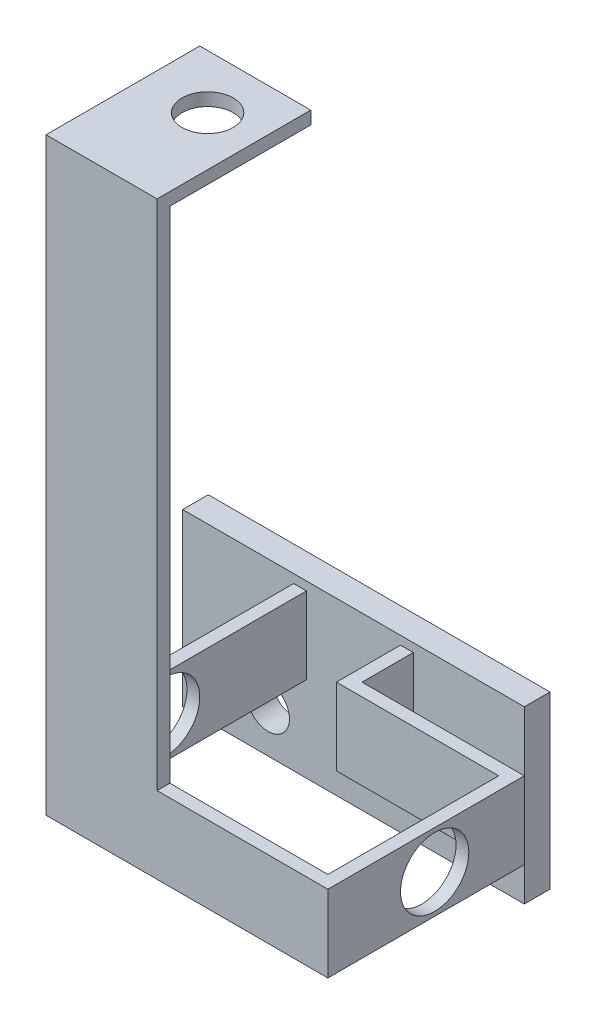
ISO-10303-21;
HEADER;
FILE_DESCRIPTION(('STEP AP214'),'2;1');
FILE_NAME('part.step','',(''),(''),'','','');
FILE_SCHEMA(('AUTOMOTIVE_DESIGN { 1 0 10303 214 1 1 1 1 }'));
ENDSEC;
DATA;
#1=APPLICATION_CONTEXT('core data for automotive mechanical design processes');
#2=APPLICATION_PROTOCOL_DEFINITION('international standard','automotive_design',2000,#1);
#3=PRODUCT_CONTEXT('',#1,'mechanical');
#4=PRODUCT('Part','Part','',(#3));
#5=PRODUCT_RELATED_PRODUCT_CATEGORY('part','',(#4));
#6=PRODUCT_DEFINITION_FORMATION('','',#4);
#7=PRODUCT_DEFINITION_CONTEXT('part definition',#1,'design');
#8=PRODUCT_DEFINITION('design','',#6,#7);
#9=PRODUCT_DEFINITION_SHAPE('','',#8);
#10=(LENGTH_UNIT() NAMED_UNIT(*) SI_UNIT(.MILLI.,.METRE.));
#11=(NAMED_UNIT(*) PLANE_ANGLE_UNIT() SI_UNIT($,.RADIAN.));
#12=(NAMED_UNIT(*) SI_UNIT($,.STERADIAN.) SOLID_ANGLE_UNIT());
#13=UNCERTAINTY_MEASURE_WITH_UNIT(LENGTH_MEASURE(1.E-05),#10,'distance_accuracy_value','');
#14=(GEOMETRIC_REPRESENTATION_CONTEXT(3) GLOBAL_UNCERTAINTY_ASSIGNED_CONTEXT((#13)) GLOBAL_UNIT_ASSIGNED_CONTEXT((#10,
#11,#12)) REPRESENTATION_CONTEXT('',''));
#15=CARTESIAN_POINT('',(0.,0.,0.));
#16=DIRECTION('',(0.,0.,1.));
#17=DIRECTION('',(1.,0.,0.));
#18=AXIS2_PLACEMENT_3D('',#15,#16,#17);
#19=CARTESIAN_POINT('',(13.,79.,22.));
#20=DIRECTION('',(0.,0.,1.));
#21=DIRECTION('',(1.,0.,0.));
#22=AXIS2_PLACEMENT_3D('',#19,#20,#21);
#23=PLANE('',#22);
#24=DIRECTION('',(0.,-1.,0.));
#25=VECTOR('',#24,1.);
#26=CARTESIAN_POINT('',(13.,79.,22.));
#27=LINE('',#26,#25);
#28=CARTESIAN_POINT('',(13.,42.5,22.));
#29=VERTEX_POINT('',#28);
#30=CARTESIAN_POINT('',(13.,19.,22.));
#31=VERTEX_POINT('',#30);
#32=EDGE_CURVE('E237',#29,#31,#27,.T.);
#33=ORIENTED_EDGE('',*,*,#32,.F.);
#34=DIRECTION('',(1.,0.,0.));
#35=VECTOR('',#34,1.);
#36=CARTESIAN_POINT('',(13.,42.5,22.));
#37=LINE('',#36,#35);
#38=CARTESIAN_POINT('',(14.5,42.5,22.));
#39=VERTEX_POINT('',#38);
#40=EDGE_CURVE('E245',#29,#39,#37,.T.);
#41=ORIENTED_EDGE('',*,*,#40,.T.);
#42=DIRECTION('',(0.,-1.,0.));
#43=VECTOR('',#42,1.);
#44=CARTESIAN_POINT('',(14.5,93.3003496460751,22.));
#45=LINE('',#44,#43);
#46=CARTESIAN_POINT('',(14.5,19.,22.));
#47=VERTEX_POINT('',#46);
#48=EDGE_CURVE('E278',#39,#47,#45,.T.);
#49=ORIENTED_EDGE('',*,*,#48,.T.);
#50=DIRECTION('',(-1.,0.,0.));
#51=VECTOR('',#50,1.);
#52=CARTESIAN_POINT('',(13.,19.,22.));
#53=LINE('',#52,#51);
#54=EDGE_CURVE('E248',#47,#31,#53,.T.);
#55=ORIENTED_EDGE('',*,*,#54,.T.);
#56=EDGE_LOOP('',(#33,#41,#49,#55));
#57=FACE_BOUND('',#56,.T.);
#58=ADVANCED_FACE('F46',(#57),#23,.F.);
#59=CARTESIAN_POINT('',(0.,19.,32.));
#60=DIRECTION('',(0.,-1.,0.));
#61=DIRECTION('',(0.,0.,-1.));
#62=AXIS2_PLACEMENT_3D('',#59,#60,#61);
#63=PLANE('',#62);
#64=DIRECTION('',(0.,0.,-1.));
#65=VECTOR('',#64,1.);
#66=CARTESIAN_POINT('',(26.,19.,32.));
#67=LINE('',#66,#65);
#68=CARTESIAN_POINT('',(26.,19.,32.));
#69=VERTEX_POINT('',#68);
#70=CARTESIAN_POINT('',(26.,19.,30.5));
#71=VERTEX_POINT('',#70);
#72=EDGE_CURVE('E285',#69,#71,#67,.T.);
#73=ORIENTED_EDGE('',*,*,#72,.F.);
#74=DIRECTION('',(-1.,0.,0.));
#75=VECTOR('',#74,1.);
#76=CARTESIAN_POINT('',(0.,19.,32.));
#77=LINE('',#76,#75);
#78=CARTESIAN_POINT('',(46.,19.,32.));
#79=VERTEX_POINT('',#78);
#80=EDGE_CURVE('E468',#79,#69,#77,.T.);
#81=ORIENTED_EDGE('',*,*,#80,.F.);
#82=DIRECTION('',(0.,0.,1.));
#83=VECTOR('',#82,1.);
#84=CARTESIAN_POINT('',(46.,19.,32.));
#85=LINE('',#84,#83);
#86=CARTESIAN_POINT('',(46.,19.,9.));
#87=VERTEX_POINT('',#86);
#88=EDGE_CURVE('E347',#87,#79,#85,.T.);
#89=ORIENTED_EDGE('',*,*,#88,.F.);
#90=DIRECTION('',(-1.,0.,0.));
#91=VECTOR('',#90,1.);
#92=CARTESIAN_POINT('',(46.,19.,9.));
#93=LINE('',#92,#91);
#94=CARTESIAN_POINT('',(27.,19.,9.));
#95=VERTEX_POINT('',#94);
#96=EDGE_CURVE('E351',#87,#95,#93,.T.);
#97=ORIENTED_EDGE('',*,*,#96,.T.);
#98=DIRECTION('',(0.,0.,-1.));
#99=VECTOR('',#98,1.);
#100=CARTESIAN_POINT('',(27.,19.,32.));
#101=LINE('',#100,#99);
#102=CARTESIAN_POINT('',(27.,19.,3.));
#103=VERTEX_POINT('',#102);
#104=EDGE_CURVE('E482',#95,#103,#101,.T.);
#105=ORIENTED_EDGE('',*,*,#104,.T.);
#106=DIRECTION('',(-1.,0.,0.));
#107=VECTOR('',#106,1.);
#108=CARTESIAN_POINT('',(0.,19.,3.));
#109=LINE('',#108,#107);
#110=CARTESIAN_POINT('',(25.5,19.,3.));
#111=VERTEX_POINT('',#110);
#112=EDGE_CURVE('E405',#103,#111,#109,.T.);
#113=ORIENTED_EDGE('',*,*,#112,.T.);
#114=DIRECTION('',(0.,0.,1.));
#115=VECTOR('',#114,1.);
#116=CARTESIAN_POINT('',(25.5,19.,32.));
#117=LINE('',#116,#115);
#118=CARTESIAN_POINT('',(25.5,19.,10.5));
#119=VERTEX_POINT('',#118);
#120=EDGE_CURVE('E378',#111,#119,#117,.T.);
#121=ORIENTED_EDGE('',*,*,#120,.T.);
#122=DIRECTION('',(1.,0.,0.));
#123=VECTOR('',#122,1.);
#124=CARTESIAN_POINT('',(0.,19.,10.5));
#125=LINE('',#124,#123);
#126=CARTESIAN_POINT('',(44.5,19.,10.5));
#127=VERTEX_POINT('',#126);
#128=EDGE_CURVE('E322',#119,#127,#125,.T.);
#129=ORIENTED_EDGE('',*,*,#128,.T.);
#130=DIRECTION('',(0.,0.,1.));
#131=VECTOR('',#130,1.);
#132=CARTESIAN_POINT('',(44.5,19.,32.));
#133=LINE('',#132,#131);
#134=CARTESIAN_POINT('',(44.5,19.,30.5));
#135=VERTEX_POINT('',#134);
#136=EDGE_CURVE('E496',#127,#135,#133,.T.);
#137=ORIENTED_EDGE('',*,*,#136,.T.);
#138=DIRECTION('',(-1.,0.,0.));
#139=VECTOR('',#138,1.);
#140=CARTESIAN_POINT('',(0.,19.,30.5));
#141=LINE('',#140,#139);
#142=EDGE_CURVE('E488',#135,#71,#141,.T.);
#143=ORIENTED_EDGE('',*,*,#142,.T.);
#144=EDGE_LOOP('',(#73,#81,#89,#97,#105,#113,#121,#129,#137,#143));
#145=FACE_BOUND('',#144,.T.);
#146=ADVANCED_FACE('F562',(#145),#63,.F.);
#147=ORIENTED_EDGE('',*,*,#54,.F.);
#148=DIRECTION('',(0.,0.,-1.));
#149=VECTOR('',#148,1.);
#150=CARTESIAN_POINT('',(14.5,19.,32.));
#151=LINE('',#150,#149);
#152=CARTESIAN_POINT('',(14.5,19.,3.));
#153=VERTEX_POINT('',#152);
#154=EDGE_CURVE('E367',#47,#153,#151,.T.);
#155=ORIENTED_EDGE('',*,*,#154,.T.);
#156=CARTESIAN_POINT('',(13.,19.,3.));
#157=VERTEX_POINT('',#156);
#158=EDGE_CURVE('E404',#153,#157,#109,.T.);
#159=ORIENTED_EDGE('',*,*,#158,.T.);
#160=DIRECTION('',(0.,0.,-1.));
#161=VECTOR('',#160,1.);
#162=CARTESIAN_POINT('',(13.,19.,32.));
#163=LINE('',#162,#161);
#164=EDGE_CURVE('E479',#31,#157,#163,.T.);
#165=ORIENTED_EDGE('',*,*,#164,.F.);
#166=EDGE_LOOP('',(#147,#155,#159,#165));
#167=FACE_BOUND('',#166,.T.);
#168=ADVANCED_FACE('F512',(#167),#63,.F.);
#169=CARTESIAN_POINT('',(27.,0.,32.));
#170=DIRECTION('',(1.,0.,0.));
#171=DIRECTION('',(0.,1.,0.));
#172=AXIS2_PLACEMENT_3D('',#169,#170,#171);
#173=PLANE('',#172);
#174=ORIENTED_EDGE('',*,*,#104,.F.);
#175=DIRECTION('',(0.,1.,0.));
#176=VECTOR('',#175,1.);
#177=CARTESIAN_POINT('',(27.,19.,9.));
#178=LINE('',#177,#176);
#179=CARTESIAN_POINT('',(27.,10.,9.));
#180=VERTEX_POINT('',#179);
#181=EDGE_CURVE('E336',#180,#95,#178,.T.);
#182=ORIENTED_EDGE('',*,*,#181,.F.);
#183=DIRECTION('',(0.,0.,-1.));
#184=VECTOR('',#183,1.);
#185=CARTESIAN_POINT('',(27.,10.,32.));
#186=LINE('',#185,#184);
#187=CARTESIAN_POINT('',(27.,10.,3.));
#188=VERTEX_POINT('',#187);
#189=EDGE_CURVE('E485',#180,#188,#186,.T.);
#190=ORIENTED_EDGE('',*,*,#189,.T.);
#191=DIRECTION('',(0.,-1.,0.));
#192=VECTOR('',#191,1.);
#193=CARTESIAN_POINT('',(27.,0.,3.));
#194=LINE('',#193,#192);
#195=EDGE_CURVE('E390',#103,#188,#194,.T.);
#196=ORIENTED_EDGE('',*,*,#195,.F.);
#197=EDGE_LOOP('',(#174,#182,#190,#196));
#198=FACE_BOUND('',#197,.T.);
#199=ADVANCED_FACE('F608',(#198),#173,.T.);
#200=CARTESIAN_POINT('',(0.,10.,32.));
#201=DIRECTION('',(0.,-1.,0.));
#202=DIRECTION('',(1.,0.,0.));
#203=AXIS2_PLACEMENT_3D('',#200,#201,#202);
#204=PLANE('',#203);
#205=DIRECTION('',(1.,0.,0.));
#206=VECTOR('',#205,1.);
#207=CARTESIAN_POINT('',(0.,10.,10.5));
#208=LINE('',#207,#206);
#209=CARTESIAN_POINT('',(25.5,10.,10.5));
#210=VERTEX_POINT('',#209);
#211=CARTESIAN_POINT('',(44.5,10.,10.5));
#212=VERTEX_POINT('',#211);
#213=EDGE_CURVE('E329',#210,#212,#208,.T.);
#214=ORIENTED_EDGE('',*,*,#213,.F.);
#215=DIRECTION('',(0.,0.,1.));
#216=VECTOR('',#215,1.);
#217=CARTESIAN_POINT('',(25.5,10.,32.));
#218=LINE('',#217,#216);
#219=CARTESIAN_POINT('',(25.5,10.,3.));
#220=VERTEX_POINT('',#219);
#221=EDGE_CURVE('E382',#220,#210,#218,.T.);
#222=ORIENTED_EDGE('',*,*,#221,.F.);
#223=DIRECTION('',(-1.,0.,0.));
#224=VECTOR('',#223,1.);
#225=CARTESIAN_POINT('',(0.,10.,3.));
#226=LINE('',#225,#224);
#227=EDGE_CURVE('E396',#188,#220,#226,.T.);
#228=ORIENTED_EDGE('',*,*,#227,.F.);
#229=ORIENTED_EDGE('',*,*,#189,.F.);
#230=DIRECTION('',(-1.,0.,0.));
#231=VECTOR('',#230,1.);
#232=CARTESIAN_POINT('',(46.,10.,9.));
#233=LINE('',#232,#231);
#234=CARTESIAN_POINT('',(46.,10.,9.));
#235=VERTEX_POINT('',#234);
#236=EDGE_CURVE('E358',#235,#180,#233,.T.);
#237=ORIENTED_EDGE('',*,*,#236,.F.);
#238=DIRECTION('',(0.,0.,-1.));
#239=VECTOR('',#238,1.);
#240=CARTESIAN_POINT('',(46.,10.,32.));
#241=LINE('',#240,#239);
#242=CARTESIAN_POINT('',(46.,10.,32.));
#243=VERTEX_POINT('',#242);
#244=EDGE_CURVE('E341',#243,#235,#241,.T.);
#245=ORIENTED_EDGE('',*,*,#244,.F.);
#246=DIRECTION('',(-1.,0.,0.));
#247=VECTOR('',#246,1.);
#248=CARTESIAN_POINT('',(0.,10.,32.));
#249=LINE('',#248,#247);
#250=CARTESIAN_POINT('',(13.,10.,32.));
#251=VERTEX_POINT('',#250);
#252=EDGE_CURVE('E464',#243,#251,#249,.T.);
#253=ORIENTED_EDGE('',*,*,#252,.T.);
#254=DIRECTION('',(0.,0.,-1.));
#255=VECTOR('',#254,1.);
#256=CARTESIAN_POINT('',(13.,10.,32.));
#257=LINE('',#256,#255);
#258=CARTESIAN_POINT('',(13.,10.,3.));
#259=VERTEX_POINT('',#258);
#260=EDGE_CURVE('E475',#251,#259,#257,.T.);
#261=ORIENTED_EDGE('',*,*,#260,.T.);
#262=CARTESIAN_POINT('',(14.5,10.,3.));
#263=VERTEX_POINT('',#262);
#264=EDGE_CURVE('E394',#263,#259,#226,.T.);
#265=ORIENTED_EDGE('',*,*,#264,.F.);
#266=DIRECTION('',(0.,0.,-1.));
#267=VECTOR('',#266,1.);
#268=CARTESIAN_POINT('',(14.5,10.,32.));
#269=LINE('',#268,#267);
#270=CARTESIAN_POINT('',(14.5,10.,30.5));
#271=VERTEX_POINT('',#270);
#272=EDGE_CURVE('E375',#271,#263,#269,.T.);
#273=ORIENTED_EDGE('',*,*,#272,.F.);
#274=DIRECTION('',(-1.,0.,0.));
#275=VECTOR('',#274,1.);
#276=CARTESIAN_POINT('',(0.,10.,30.5));
#277=LINE('',#276,#275);
#278=CARTESIAN_POINT('',(44.5,10.,30.5));
#279=VERTEX_POINT('',#278);
#280=EDGE_CURVE('E386',#279,#271,#277,.T.);
#281=ORIENTED_EDGE('',*,*,#280,.F.);
#282=DIRECTION('',(0.,0.,1.));
#283=VECTOR('',#282,1.);
#284=CARTESIAN_POINT('',(44.5,10.,32.));
#285=LINE('',#284,#283);
#286=EDGE_CURVE('E332',#212,#279,#285,.T.);
#287=ORIENTED_EDGE('',*,*,#286,.F.);
#288=EDGE_LOOP('',(#214,#222,#228,#229,#237,#245,#253,#261,#265,#273,#281,#287));
#289=FACE_BOUND('',#288,.T.);
#290=ADVANCED_FACE('F519',(#289),#204,.T.);
#291=CARTESIAN_POINT('',(13.,0.,32.));
#292=DIRECTION('',(1.,0.,0.));
#293=DIRECTION('',(0.,1.,0.));
#294=AXIS2_PLACEMENT_3D('',#291,#292,#293);
#295=PLANE('',#294);
#296=CARTESIAN_POINT('',(13.,14.5,19.5));
#297=DIRECTION('',(1.,0.,0.));
#298=DIRECTION('',(0.,1.,0.));
#299=AXIS2_PLACEMENT_3D('',#296,#297,#298);
#300=CIRCLE('',#299,4.);
#301=CARTESIAN_POINT('',(13.,18.5,19.5));
#302=VERTEX_POINT('',#301);
#303=EDGE_CURVE('E313',#302,#302,#300,.T.);
#304=ORIENTED_EDGE('',*,*,#303,.T.);
#305=EDGE_LOOP('',(#304));
#306=FACE_BOUND('',#305,.T.);
#307=DIRECTION('',(0.,0.,1.));
#308=VECTOR('',#307,1.);
#309=CARTESIAN_POINT('',(13.,77.5,14.));
#310=LINE('',#309,#308);
#311=CARTESIAN_POINT('',(13.,77.5,14.));
#312=VERTEX_POINT('',#311);
#313=CARTESIAN_POINT('',(13.,77.5,30.5));
#314=VERTEX_POINT('',#313);
#315=EDGE_CURVE('E276',#312,#314,#310,.T.);
#316=ORIENTED_EDGE('',*,*,#315,.T.);
#317=DIRECTION('',(0.,-1.,0.));
#318=VECTOR('',#317,1.);
#319=CARTESIAN_POINT('',(13.,77.5,30.5));
#320=LINE('',#319,#318);
#321=CARTESIAN_POINT('',(13.,52.3868599666426,30.5));
#322=VERTEX_POINT('',#321);
#323=EDGE_CURVE('E239',#314,#322,#320,.T.);
#324=ORIENTED_EDGE('',*,*,#323,.T.);
#325=CARTESIAN_POINT('',(13.,52.3868599666426,20.5));
#326=DIRECTION('',(1.,0.,0.));
#327=DIRECTION('',(0.,1.,0.));
#328=AXIS2_PLACEMENT_3D('',#325,#326,#327);
#329=CIRCLE('',#328,10.);
#330=EDGE_CURVE('E12',#322,#29,#329,.T.);
#331=ORIENTED_EDGE('',*,*,#330,.T.);
#332=ORIENTED_EDGE('',*,*,#32,.T.);
#333=ORIENTED_EDGE('',*,*,#164,.T.);
#334=DIRECTION('',(0.,-1.,0.));
#335=VECTOR('',#334,1.);
#336=CARTESIAN_POINT('',(13.,0.,3.));
#337=LINE('',#336,#335);
#338=EDGE_CURVE('E400',#157,#259,#337,.T.);
#339=ORIENTED_EDGE('',*,*,#338,.T.);
#340=ORIENTED_EDGE('',*,*,#260,.F.);
#341=DIRECTION('',(0.,-1.,0.));
#342=VECTOR('',#341,1.);
#343=CARTESIAN_POINT('',(13.,0.,32.));
#344=LINE('',#343,#342);
#345=CARTESIAN_POINT('',(13.,79.,32.));
#346=VERTEX_POINT('',#345);
#347=EDGE_CURVE('E472',#346,#251,#344,.T.);
#348=ORIENTED_EDGE('',*,*,#347,.F.);
#349=DIRECTION('',(0.,0.,1.));
#350=VECTOR('',#349,1.);
#351=CARTESIAN_POINT('',(13.,79.,32.));
#352=LINE('',#351,#350);
#353=CARTESIAN_POINT('',(13.,79.,14.));
#354=VERTEX_POINT('',#353);
#355=EDGE_CURVE('E290',#354,#346,#352,.T.);
#356=ORIENTED_EDGE('',*,*,#355,.F.);
#357=DIRECTION('',(0.,1.,0.));
#358=VECTOR('',#357,1.);
#359=CARTESIAN_POINT('',(13.,79.,14.));
#360=LINE('',#359,#358);
#361=EDGE_CURVE('E270',#312,#354,#360,.T.);
#362=ORIENTED_EDGE('',*,*,#361,.F.);
#363=EDGE_LOOP('',(#316,#324,#331,#332,#333,#339,#340,#348,#356,#362));
#364=FACE_BOUND('',#363,.T.);
#365=ADVANCED_FACE('F236',(#306,#364),#295,.F.);
#366=CARTESIAN_POINT('',(0.,0.,32.));
#367=DIRECTION('',(0.,0.,1.));
#368=DIRECTION('',(1.,0.,0.));
#369=AXIS2_PLACEMENT_3D('',#366,#367,#368);
#370=PLANE('',#369);
#371=ORIENTED_EDGE('',*,*,#252,.F.);
#372=DIRECTION('',(0.,-1.,0.));
#373=VECTOR('',#372,1.);
#374=CARTESIAN_POINT('',(46.,19.,32.));
#375=LINE('',#374,#373);
#376=EDGE_CURVE('E337',#79,#243,#375,.T.);
#377=ORIENTED_EDGE('',*,*,#376,.F.);
#378=ORIENTED_EDGE('',*,*,#80,.T.);
#379=DIRECTION('',(0.,-1.,0.));
#380=VECTOR('',#379,1.);
#381=CARTESIAN_POINT('',(26.,79.,32.));
#382=LINE('',#381,#380);
#383=CARTESIAN_POINT('',(26.,79.,32.));
#384=VERTEX_POINT('',#383);
#385=EDGE_CURVE('E250',#384,#69,#382,.T.);
#386=ORIENTED_EDGE('',*,*,#385,.F.);
#387=DIRECTION('',(1.,0.,0.));
#388=VECTOR('',#387,1.);
#389=CARTESIAN_POINT('',(13.,79.,32.));
#390=LINE('',#389,#388);
#391=EDGE_CURVE('E293',#346,#384,#390,.T.);
#392=ORIENTED_EDGE('',*,*,#391,.F.);
#393=ORIENTED_EDGE('',*,*,#347,.T.);
#394=EDGE_LOOP('',(#371,#377,#378,#386,#392,#393));
#395=FACE_BOUND('',#394,.T.);
#396=ADVANCED_FACE('F525',(#395),#370,.T.);
#397=CARTESIAN_POINT('',(0.,0.,3.));
#398=DIRECTION('',(0.,1.,0.));
#399=DIRECTION('',(0.,0.,1.));
#400=AXIS2_PLACEMENT_3D('',#397,#398,#399);
#401=PLANE('',#400);
#402=DIRECTION('',(1.,0.,0.));
#403=VECTOR('',#402,1.);
#404=CARTESIAN_POINT('',(0.,0.,0.));
#405=LINE('',#404,#403);
#406=CARTESIAN_POINT('',(0.,0.,0.));
#407=VERTEX_POINT('',#406);
#408=CARTESIAN_POINT('',(40.,0.,0.));
#409=VERTEX_POINT('',#408);
#410=EDGE_CURVE('E434',#407,#409,#405,.T.);
#411=ORIENTED_EDGE('',*,*,#410,.T.);
#412=DIRECTION('',(0.,0.,-1.));
#413=VECTOR('',#412,1.);
#414=CARTESIAN_POINT('',(40.,0.,3.));
#415=LINE('',#414,#413);
#416=CARTESIAN_POINT('',(40.,0.,3.));
#417=VERTEX_POINT('',#416);
#418=EDGE_CURVE('E461',#417,#409,#415,.T.);
#419=ORIENTED_EDGE('',*,*,#418,.F.);
#420=DIRECTION('',(1.,0.,0.));
#421=VECTOR('',#420,1.);
#422=CARTESIAN_POINT('',(0.,0.,3.));
#423=LINE('',#422,#421);
#424=CARTESIAN_POINT('',(0.,0.,3.));
#425=VERTEX_POINT('',#424);
#426=EDGE_CURVE('E413',#425,#417,#423,.T.);
#427=ORIENTED_EDGE('',*,*,#426,.F.);
#428=DIRECTION('',(0.,0.,-1.));
#429=VECTOR('',#428,1.);
#430=CARTESIAN_POINT('',(0.,0.,3.));
#431=LINE('',#430,#429);
#432=EDGE_CURVE('E430',#425,#407,#431,.T.);
#433=ORIENTED_EDGE('',*,*,#432,.T.);
#434=EDGE_LOOP('',(#411,#419,#427,#433));
#435=FACE_BOUND('',#434,.T.);
#436=ADVANCED_FACE('F638',(#435),#401,.F.);
#437=CARTESIAN_POINT('',(40.,0.,3.));
#438=DIRECTION('',(-1.,0.,0.));
#439=DIRECTION('',(0.,0.,1.));
#440=AXIS2_PLACEMENT_3D('',#437,#438,#439);
#441=PLANE('',#440);
#442=DIRECTION('',(0.,1.,0.));
#443=VECTOR('',#442,1.);
#444=CARTESIAN_POINT('',(40.,0.,0.));
#445=LINE('',#444,#443);
#446=CARTESIAN_POINT('',(40.,20.,0.));
#447=VERTEX_POINT('',#446);
#448=EDGE_CURVE('E438',#409,#447,#445,.T.);
#449=ORIENTED_EDGE('',*,*,#448,.T.);
#450=DIRECTION('',(0.,0.,-1.));
#451=VECTOR('',#450,1.);
#452=CARTESIAN_POINT('',(40.,20.,3.));
#453=LINE('',#452,#451);
#454=CARTESIAN_POINT('',(40.,20.,3.));
#455=VERTEX_POINT('',#454);
#456=EDGE_CURVE('E458',#455,#447,#453,.T.);
#457=ORIENTED_EDGE('',*,*,#456,.F.);
#458=DIRECTION('',(0.,1.,0.));
#459=VECTOR('',#458,1.);
#460=CARTESIAN_POINT('',(40.,0.,3.));
#461=LINE('',#460,#459);
#462=EDGE_CURVE('E416',#417,#455,#461,.T.);
#463=ORIENTED_EDGE('',*,*,#462,.F.);
#464=ORIENTED_EDGE('',*,*,#418,.T.);
#465=EDGE_LOOP('',(#449,#457,#463,#464));
#466=FACE_BOUND('',#465,.T.);
#467=ADVANCED_FACE('F634',(#466),#441,.F.);
#468=CARTESIAN_POINT('',(0.,20.,3.));
#469=DIRECTION('',(0.,1.,0.));
#470=DIRECTION('',(0.,0.,1.));
#471=AXIS2_PLACEMENT_3D('',#468,#469,#470);
#472=PLANE('',#471);
#473=DIRECTION('',(1.,0.,0.));
#474=VECTOR('',#473,1.);
#475=CARTESIAN_POINT('',(0.,20.,0.));
#476=LINE('',#475,#474);
#477=CARTESIAN_POINT('',(0.,20.,0.));
#478=VERTEX_POINT('',#477);
#479=EDGE_CURVE('E442',#478,#447,#476,.T.);
#480=ORIENTED_EDGE('',*,*,#479,.F.);
#481=DIRECTION('',(0.,0.,-1.));
#482=VECTOR('',#481,1.);
#483=CARTESIAN_POINT('',(0.,20.,3.));
#484=LINE('',#483,#482);
#485=CARTESIAN_POINT('',(0.,20.,3.));
#486=VERTEX_POINT('',#485);
#487=EDGE_CURVE('E455',#486,#478,#484,.T.);
#488=ORIENTED_EDGE('',*,*,#487,.F.);
#489=DIRECTION('',(1.,0.,0.));
#490=VECTOR('',#489,1.);
#491=CARTESIAN_POINT('',(0.,20.,3.));
#492=LINE('',#491,#490);
#493=EDGE_CURVE('E419',#486,#455,#492,.T.);
#494=ORIENTED_EDGE('',*,*,#493,.T.);
#495=ORIENTED_EDGE('',*,*,#456,.T.);
#496=EDGE_LOOP('',(#480,#488,#494,#495));
#497=FACE_BOUND('',#496,.T.);
#498=ADVANCED_FACE('F630',(#497),#472,.T.);
#499=CARTESIAN_POINT('',(0.,0.,3.));
#500=DIRECTION('',(-1.,0.,0.));
#501=DIRECTION('',(0.,0.,1.));
#502=AXIS2_PLACEMENT_3D('',#499,#500,#501);
#503=PLANE('',#502);
#504=DIRECTION('',(0.,1.,0.));
#505=VECTOR('',#504,1.);
#506=CARTESIAN_POINT('',(0.,0.,0.));
#507=LINE('',#506,#505);
#508=EDGE_CURVE('E446',#407,#478,#507,.T.);
#509=ORIENTED_EDGE('',*,*,#508,.F.);
#510=ORIENTED_EDGE('',*,*,#432,.F.);
#511=DIRECTION('',(0.,1.,0.));
#512=VECTOR('',#511,1.);
#513=CARTESIAN_POINT('',(0.,0.,3.));
#514=LINE('',#513,#512);
#515=EDGE_CURVE('E422',#425,#486,#514,.T.);
#516=ORIENTED_EDGE('',*,*,#515,.T.);
#517=ORIENTED_EDGE('',*,*,#487,.T.);
#518=EDGE_LOOP('',(#509,#510,#516,#517));
#519=FACE_BOUND('',#518,.T.);
#520=ADVANCED_FACE('F627',(#519),#503,.T.);
#521=CARTESIAN_POINT('',(10.,5.,3.));
#522=DIRECTION('',(0.,0.,-1.));
#523=DIRECTION('',(-1.,0.,0.));
#524=AXIS2_PLACEMENT_3D('',#521,#522,#523);
#525=CYLINDRICAL_SURFACE('',#524,2.5);
#526=CARTESIAN_POINT('',(10.,5.,3.));
#527=DIRECTION('',(0.,0.,1.));
#528=DIRECTION('',(1.,0.,0.));
#529=AXIS2_PLACEMENT_3D('',#526,#527,#528);
#530=CIRCLE('',#529,2.5);
#531=CARTESIAN_POINT('',(12.5,5.,3.));
#532=VERTEX_POINT('',#531);
#533=EDGE_CURVE('E409',#532,#532,#530,.T.);
#534=ORIENTED_EDGE('',*,*,#533,.T.);
#535=EDGE_LOOP('',(#534));
#536=FACE_BOUND('',#535,.T.);
#537=CARTESIAN_POINT('',(10.,5.,0.));
#538=DIRECTION('',(0.,0.,1.));
#539=DIRECTION('',(1.,0.,0.));
#540=AXIS2_PLACEMENT_3D('',#537,#538,#539);
#541=CIRCLE('',#540,2.5);
#542=CARTESIAN_POINT('',(12.5,5.,0.));
#543=VERTEX_POINT('',#542);
#544=EDGE_CURVE('E389',#543,#543,#541,.T.);
#545=ORIENTED_EDGE('',*,*,#544,.F.);
#546=EDGE_LOOP('',(#545));
#547=FACE_BOUND('',#546,.T.);
#548=ADVANCED_FACE('F623',(#536,#547),#525,.F.);
#549=CARTESIAN_POINT('',(30.,5.,3.));
#550=DIRECTION('',(0.,0.,-1.));
#551=DIRECTION('',(-1.,0.,0.));
#552=AXIS2_PLACEMENT_3D('',#549,#550,#551);
#553=CYLINDRICAL_SURFACE('',#552,2.5);
#554=CARTESIAN_POINT('',(30.,5.,3.));
#555=DIRECTION('',(0.,0.,1.));
#556=DIRECTION('',(1.,0.,0.));
#557=AXIS2_PLACEMENT_3D('',#554,#555,#556);
#558=CIRCLE('',#557,2.5);
#559=CARTESIAN_POINT('',(32.5,5.,3.));
#560=VERTEX_POINT('',#559);
#561=EDGE_CURVE('E426',#560,#560,#558,.T.);
#562=ORIENTED_EDGE('',*,*,#561,.T.);
#563=EDGE_LOOP('',(#562));
#564=FACE_BOUND('',#563,.T.);
#565=CARTESIAN_POINT('',(30.,5.,0.));
#566=DIRECTION('',(0.,0.,1.));
#567=DIRECTION('',(1.,0.,0.));
#568=AXIS2_PLACEMENT_3D('',#565,#566,#567);
#569=CIRCLE('',#568,2.5);
#570=CARTESIAN_POINT('',(32.5,5.,0.));
#571=VERTEX_POINT('',#570);
#572=EDGE_CURVE('E395',#571,#571,#569,.T.);
#573=ORIENTED_EDGE('',*,*,#572,.F.);
#574=EDGE_LOOP('',(#573));
#575=FACE_BOUND('',#574,.T.);
#576=ADVANCED_FACE('F618',(#564,#575),#553,.F.);
#577=CARTESIAN_POINT('',(0.,0.,3.));
#578=DIRECTION('',(0.,0.,1.));
#579=DIRECTION('',(1.,0.,0.));
#580=AXIS2_PLACEMENT_3D('',#577,#578,#579);
#581=PLANE('',#580);
#582=DIRECTION('',(0.,1.,0.));
#583=VECTOR('',#582,1.);
#584=CARTESIAN_POINT('',(14.5,0.,3.));
#585=LINE('',#584,#583);
#586=EDGE_CURVE('E362',#263,#153,#585,.T.);
#587=ORIENTED_EDGE('',*,*,#586,.F.);
#588=ORIENTED_EDGE('',*,*,#264,.T.);
#589=ORIENTED_EDGE('',*,*,#338,.F.);
#590=ORIENTED_EDGE('',*,*,#158,.F.);
#591=EDGE_LOOP('',(#587,#588,#589,#590));
#592=FACE_BOUND('',#591,.T.);
#593=ORIENTED_EDGE('',*,*,#227,.T.);
#594=DIRECTION('',(0.,1.,0.));
#595=VECTOR('',#594,1.);
#596=CARTESIAN_POINT('',(25.5,0.,3.));
#597=LINE('',#596,#595);
#598=EDGE_CURVE('E363',#220,#111,#597,.T.);
#599=ORIENTED_EDGE('',*,*,#598,.T.);
#600=ORIENTED_EDGE('',*,*,#112,.F.);
#601=ORIENTED_EDGE('',*,*,#195,.T.);
#602=EDGE_LOOP('',(#593,#599,#600,#601));
#603=FACE_BOUND('',#602,.T.);
#604=ORIENTED_EDGE('',*,*,#426,.T.);
#605=ORIENTED_EDGE('',*,*,#462,.T.);
#606=ORIENTED_EDGE('',*,*,#493,.F.);
#607=ORIENTED_EDGE('',*,*,#515,.F.);
#608=EDGE_LOOP('',(#604,#605,#606,#607));
#609=FACE_BOUND('',#608,.T.);
#610=ORIENTED_EDGE('',*,*,#533,.F.);
#611=EDGE_LOOP('',(#610));
#612=FACE_BOUND('',#611,.T.);
#613=ORIENTED_EDGE('',*,*,#561,.F.);
#614=EDGE_LOOP('',(#613));
#615=FACE_BOUND('',#614,.T.);
#616=ADVANCED_FACE('F557',(#592,#603,#609,#612,#615),#581,.T.);
#617=CARTESIAN_POINT('',(0.,0.,0.));
#618=DIRECTION('',(0.,0.,1.));
#619=DIRECTION('',(1.,0.,0.));
#620=AXIS2_PLACEMENT_3D('',#617,#618,#619);
#621=PLANE('',#620);
#622=ORIENTED_EDGE('',*,*,#544,.T.);
#623=EDGE_LOOP('',(#622));
#624=FACE_BOUND('',#623,.T.);
#625=ORIENTED_EDGE('',*,*,#410,.F.);
#626=ORIENTED_EDGE('',*,*,#508,.T.);
#627=ORIENTED_EDGE('',*,*,#479,.T.);
#628=ORIENTED_EDGE('',*,*,#448,.F.);
#629=EDGE_LOOP('',(#625,#626,#627,#628));
#630=FACE_BOUND('',#629,.T.);
#631=ORIENTED_EDGE('',*,*,#572,.T.);
#632=EDGE_LOOP('',(#631));
#633=FACE_BOUND('',#632,.T.);
#634=ADVANCED_FACE('F549',(#624,#630,#633),#621,.F.);
#635=CARTESIAN_POINT('',(14.5,0.,30.5));
#636=DIRECTION('',(0.,0.,1.));
#637=DIRECTION('',(1.,0.,0.));
#638=AXIS2_PLACEMENT_3D('',#635,#636,#637);
#639=PLANE('',#638);
#640=DIRECTION('',(0.,1.,0.));
#641=VECTOR('',#640,1.);
#642=CARTESIAN_POINT('',(14.5,0.,30.5));
#643=LINE('',#642,#641);
#644=CARTESIAN_POINT('',(14.5,52.3868599666426,30.5));
#645=VERTEX_POINT('',#644);
#646=EDGE_CURVE('E65',#271,#645,#643,.T.);
#647=ORIENTED_EDGE('',*,*,#646,.T.);
#648=DIRECTION('',(-1.,0.,0.));
#649=VECTOR('',#648,1.);
#650=CARTESIAN_POINT('',(14.5,52.3868599666426,30.5));
#651=LINE('',#650,#649);
#652=EDGE_CURVE('E71',#645,#322,#651,.T.);
#653=ORIENTED_EDGE('',*,*,#652,.T.);
#654=ORIENTED_EDGE('',*,*,#323,.F.);
#655=DIRECTION('',(1.,0.,0.));
#656=VECTOR('',#655,1.);
#657=CARTESIAN_POINT('',(14.5,77.5,30.5));
#658=LINE('',#657,#656);
#659=CARTESIAN_POINT('',(26.,77.5,30.5));
#660=VERTEX_POINT('',#659);
#661=EDGE_CURVE('E282',#314,#660,#658,.T.);
#662=ORIENTED_EDGE('',*,*,#661,.T.);
#663=DIRECTION('',(0.,-1.,0.));
#664=VECTOR('',#663,1.);
#665=CARTESIAN_POINT('',(26.,93.3003496460751,30.5));
#666=LINE('',#665,#664);
#667=EDGE_CURVE('E283',#660,#71,#666,.T.);
#668=ORIENTED_EDGE('',*,*,#667,.T.);
#669=ORIENTED_EDGE('',*,*,#142,.F.);
#670=DIRECTION('',(0.,1.,0.));
#671=VECTOR('',#670,1.);
#672=CARTESIAN_POINT('',(44.5,0.,30.5));
#673=LINE('',#672,#671);
#674=EDGE_CURVE('E317',#279,#135,#673,.T.);
#675=ORIENTED_EDGE('',*,*,#674,.F.);
#676=ORIENTED_EDGE('',*,*,#280,.T.);
#677=EDGE_LOOP('',(#647,#653,#654,#662,#668,#669,#675,#676));
#678=FACE_BOUND('',#677,.T.);
#679=ADVANCED_FACE('F546',(#678),#639,.F.);
#680=CARTESIAN_POINT('',(25.5,0.,3.));
#681=DIRECTION('',(1.,0.,0.));
#682=DIRECTION('',(0.,0.,-1.));
#683=AXIS2_PLACEMENT_3D('',#680,#681,#682);
#684=PLANE('',#683);
#685=ORIENTED_EDGE('',*,*,#221,.T.);
#686=DIRECTION('',(0.,1.,0.));
#687=VECTOR('',#686,1.);
#688=CARTESIAN_POINT('',(25.5,0.,10.5));
#689=LINE('',#688,#687);
#690=EDGE_CURVE('E492',#210,#119,#689,.T.);
#691=ORIENTED_EDGE('',*,*,#690,.T.);
#692=ORIENTED_EDGE('',*,*,#120,.F.);
#693=ORIENTED_EDGE('',*,*,#598,.F.);
#694=EDGE_LOOP('',(#685,#691,#692,#693));
#695=FACE_BOUND('',#694,.T.);
#696=ADVANCED_FACE('F548',(#695),#684,.F.);
#697=CARTESIAN_POINT('',(14.5,0.,3.));
#698=DIRECTION('',(-1.,0.,0.));
#699=DIRECTION('',(0.,0.,1.));
#700=AXIS2_PLACEMENT_3D('',#697,#698,#699);
#701=PLANE('',#700);
#702=CARTESIAN_POINT('',(14.5,14.5,19.5));
#703=DIRECTION('',(-1.,0.,0.));
#704=DIRECTION('',(0.,0.,1.));
#705=AXIS2_PLACEMENT_3D('',#702,#703,#704);
#706=CIRCLE('',#705,4.);
#707=CARTESIAN_POINT('',(14.5,14.5,23.5));
#708=VERTEX_POINT('',#707);
#709=EDGE_CURVE('E309',#708,#708,#706,.T.);
#710=ORIENTED_EDGE('',*,*,#709,.T.);
#711=EDGE_LOOP('',(#710));
#712=FACE_BOUND('',#711,.T.);
#713=ORIENTED_EDGE('',*,*,#48,.F.);
#714=CARTESIAN_POINT('',(14.5,52.3868599666426,20.5));
#715=DIRECTION('',(-1.,0.,0.));
#716=DIRECTION('',(0.,0.,1.));
#717=AXIS2_PLACEMENT_3D('',#714,#715,#716);
#718=CIRCLE('',#717,10.);
#719=EDGE_CURVE('E55',#39,#645,#718,.T.);
#720=ORIENTED_EDGE('',*,*,#719,.T.);
#721=ORIENTED_EDGE('',*,*,#646,.F.);
#722=ORIENTED_EDGE('',*,*,#272,.T.);
#723=ORIENTED_EDGE('',*,*,#586,.T.);
#724=ORIENTED_EDGE('',*,*,#154,.F.);
#725=EDGE_LOOP('',(#713,#720,#721,#722,#723,#724));
#726=FACE_BOUND('',#725,.T.);
#727=ADVANCED_FACE('F506',(#712,#726),#701,.F.);
#728=CARTESIAN_POINT('',(46.,19.,9.));
#729=DIRECTION('',(0.,0.,1.));
#730=DIRECTION('',(1.,0.,0.));
#731=AXIS2_PLACEMENT_3D('',#728,#729,#730);
#732=PLANE('',#731);
#733=ORIENTED_EDGE('',*,*,#181,.T.);
#734=ORIENTED_EDGE('',*,*,#96,.F.);
#735=DIRECTION('',(0.,1.,0.));
#736=VECTOR('',#735,1.);
#737=CARTESIAN_POINT('',(46.,19.,9.));
#738=LINE('',#737,#736);
#739=EDGE_CURVE('E344',#235,#87,#738,.T.);
#740=ORIENTED_EDGE('',*,*,#739,.F.);
#741=ORIENTED_EDGE('',*,*,#236,.T.);
#742=EDGE_LOOP('',(#733,#734,#740,#741));
#743=FACE_BOUND('',#742,.T.);
#744=ADVANCED_FACE('F590',(#743),#732,.F.);
#745=CARTESIAN_POINT('',(46.,0.,0.));
#746=DIRECTION('',(1.,0.,0.));
#747=DIRECTION('',(0.,1.,0.));
#748=AXIS2_PLACEMENT_3D('',#745,#746,#747);
#749=PLANE('',#748);
#750=CARTESIAN_POINT('',(46.,14.5,19.5));
#751=DIRECTION('',(-1.,0.,0.));
#752=DIRECTION('',(0.,-1.,0.));
#753=AXIS2_PLACEMENT_3D('',#750,#751,#752);
#754=CIRCLE('',#753,4.);
#755=CARTESIAN_POINT('',(46.,10.5,19.5));
#756=VERTEX_POINT('',#755);
#757=EDGE_CURVE('E304',#756,#756,#754,.T.);
#758=ORIENTED_EDGE('',*,*,#757,.T.);
#759=EDGE_LOOP('',(#758));
#760=FACE_BOUND('',#759,.T.);
#761=ORIENTED_EDGE('',*,*,#376,.T.);
#762=ORIENTED_EDGE('',*,*,#244,.T.);
#763=ORIENTED_EDGE('',*,*,#739,.T.);
#764=ORIENTED_EDGE('',*,*,#88,.T.);
#765=EDGE_LOOP('',(#761,#762,#763,#764));
#766=FACE_BOUND('',#765,.T.);
#767=ADVANCED_FACE('F586',(#760,#766),#749,.T.);
#768=CARTESIAN_POINT('',(44.5,0.,10.5));
#769=DIRECTION('',(1.,0.,0.));
#770=DIRECTION('',(0.,0.,-1.));
#771=AXIS2_PLACEMENT_3D('',#768,#769,#770);
#772=PLANE('',#771);
#773=CARTESIAN_POINT('',(44.5,14.5,19.5));
#774=DIRECTION('',(1.,0.,0.));
#775=DIRECTION('',(0.,0.,-1.));
#776=AXIS2_PLACEMENT_3D('',#773,#774,#775);
#777=CIRCLE('',#776,4.);
#778=CARTESIAN_POINT('',(44.5,14.5,15.5));
#779=VERTEX_POINT('',#778);
#780=EDGE_CURVE('E308',#779,#779,#777,.T.);
#781=ORIENTED_EDGE('',*,*,#780,.T.);
#782=EDGE_LOOP('',(#781));
#783=FACE_BOUND('',#782,.T.);
#784=ORIENTED_EDGE('',*,*,#286,.T.);
#785=ORIENTED_EDGE('',*,*,#674,.T.);
#786=ORIENTED_EDGE('',*,*,#136,.F.);
#787=DIRECTION('',(0.,1.,0.));
#788=VECTOR('',#787,1.);
#789=CARTESIAN_POINT('',(44.5,0.,10.5));
#790=LINE('',#789,#788);
#791=EDGE_CURVE('E318',#212,#127,#790,.T.);
#792=ORIENTED_EDGE('',*,*,#791,.F.);
#793=EDGE_LOOP('',(#784,#785,#786,#792));
#794=FACE_BOUND('',#793,.T.);
#795=ADVANCED_FACE('F582',(#783,#794),#772,.F.);
#796=CARTESIAN_POINT('',(25.5,0.,10.5));
#797=DIRECTION('',(0.,0.,-1.));
#798=DIRECTION('',(-1.,0.,0.));
#799=AXIS2_PLACEMENT_3D('',#796,#797,#798);
#800=PLANE('',#799);
#801=ORIENTED_EDGE('',*,*,#213,.T.);
#802=ORIENTED_EDGE('',*,*,#791,.T.);
#803=ORIENTED_EDGE('',*,*,#128,.F.);
#804=ORIENTED_EDGE('',*,*,#690,.F.);
#805=EDGE_LOOP('',(#801,#802,#803,#804));
#806=FACE_BOUND('',#805,.T.);
#807=ADVANCED_FACE('F579',(#806),#800,.F.);
#808=CARTESIAN_POINT('',(46.,14.5,19.5));
#809=DIRECTION('',(-1.,0.,0.));
#810=DIRECTION('',(0.,-1.,0.));
#811=AXIS2_PLACEMENT_3D('',#808,#809,#810);
#812=CYLINDRICAL_SURFACE('',#811,4.);
#813=ORIENTED_EDGE('',*,*,#757,.F.);
#814=EDGE_LOOP('',(#813));
#815=FACE_BOUND('',#814,.T.);
#816=ORIENTED_EDGE('',*,*,#780,.F.);
#817=EDGE_LOOP('',(#816));
#818=FACE_BOUND('',#817,.T.);
#819=ADVANCED_FACE('F577',(#815,#818),#812,.F.);
#820=ORIENTED_EDGE('',*,*,#709,.F.);
#821=EDGE_LOOP('',(#820));
#822=FACE_BOUND('',#821,.T.);
#823=ORIENTED_EDGE('',*,*,#303,.F.);
#824=EDGE_LOOP('',(#823));
#825=FACE_BOUND('',#824,.T.);
#826=ADVANCED_FACE('F574',(#822,#825),#812,.F.);
#827=CARTESIAN_POINT('',(26.,79.,32.));
#828=DIRECTION('',(-1.,0.,0.));
#829=DIRECTION('',(0.,0.,1.));
#830=AXIS2_PLACEMENT_3D('',#827,#828,#829);
#831=PLANE('',#830);
#832=ORIENTED_EDGE('',*,*,#72,.T.);
#833=ORIENTED_EDGE('',*,*,#667,.F.);
#834=DIRECTION('',(0.,0.,-1.));
#835=VECTOR('',#834,1.);
#836=CARTESIAN_POINT('',(26.,77.5,30.5));
#837=LINE('',#836,#835);
#838=CARTESIAN_POINT('',(26.,77.5,14.));
#839=VERTEX_POINT('',#838);
#840=EDGE_CURVE('E279',#660,#839,#837,.T.);
#841=ORIENTED_EDGE('',*,*,#840,.T.);
#842=DIRECTION('',(0.,-1.,0.));
#843=VECTOR('',#842,1.);
#844=CARTESIAN_POINT('',(26.,79.,14.));
#845=LINE('',#844,#843);
#846=CARTESIAN_POINT('',(26.,79.,14.));
#847=VERTEX_POINT('',#846);
#848=EDGE_CURVE('E264',#847,#839,#845,.T.);
#849=ORIENTED_EDGE('',*,*,#848,.F.);
#850=DIRECTION('',(0.,0.,-1.));
#851=VECTOR('',#850,1.);
#852=CARTESIAN_POINT('',(26.,79.,32.));
#853=LINE('',#852,#851);
#854=EDGE_CURVE('E251',#384,#847,#853,.T.);
#855=ORIENTED_EDGE('',*,*,#854,.F.);
#856=ORIENTED_EDGE('',*,*,#385,.T.);
#857=EDGE_LOOP('',(#832,#833,#841,#849,#855,#856));
#858=FACE_BOUND('',#857,.T.);
#859=ADVANCED_FACE('F539',(#858),#831,.F.);
#860=CARTESIAN_POINT('',(0.,79.,0.));
#861=DIRECTION('',(0.,-1.,0.));
#862=DIRECTION('',(0.,0.,-1.));
#863=AXIS2_PLACEMENT_3D('',#860,#861,#862);
#864=PLANE('',#863);
#865=CARTESIAN_POINT('',(20.2198624004115,79.,20.3030013590247));
#866=DIRECTION('',(0.,1.,0.));
#867=DIRECTION('',(0.,0.,1.));
#868=AXIS2_PLACEMENT_3D('',#865,#866,#867);
#869=CIRCLE('',#868,3.);
#870=CARTESIAN_POINT('',(20.2198624004115,79.,23.3030013590247));
#871=VERTEX_POINT('',#870);
#872=EDGE_CURVE('E254',#871,#871,#869,.T.);
#873=ORIENTED_EDGE('',*,*,#872,.F.);
#874=EDGE_LOOP('',(#873));
#875=FACE_BOUND('',#874,.T.);
#876=ORIENTED_EDGE('',*,*,#355,.T.);
#877=ORIENTED_EDGE('',*,*,#391,.T.);
#878=ORIENTED_EDGE('',*,*,#854,.T.);
#879=DIRECTION('',(1.,0.,0.));
#880=VECTOR('',#879,1.);
#881=CARTESIAN_POINT('',(26.,79.,14.));
#882=LINE('',#881,#880);
#883=EDGE_CURVE('E273',#354,#847,#882,.T.);
#884=ORIENTED_EDGE('',*,*,#883,.F.);
#885=EDGE_LOOP('',(#876,#877,#878,#884));
#886=FACE_BOUND('',#885,.T.);
#887=ADVANCED_FACE('F536',(#875,#886),#864,.F.);
#888=CARTESIAN_POINT('',(0.,77.5,0.));
#889=DIRECTION('',(0.,-1.,0.));
#890=DIRECTION('',(0.,0.,-1.));
#891=AXIS2_PLACEMENT_3D('',#888,#889,#890);
#892=PLANE('',#891);
#893=ORIENTED_EDGE('',*,*,#661,.F.);
#894=ORIENTED_EDGE('',*,*,#315,.F.);
#895=DIRECTION('',(-1.,0.,0.));
#896=VECTOR('',#895,1.);
#897=CARTESIAN_POINT('',(26.,77.5,14.));
#898=LINE('',#897,#896);
#899=EDGE_CURVE('E268',#839,#312,#898,.T.);
#900=ORIENTED_EDGE('',*,*,#899,.F.);
#901=ORIENTED_EDGE('',*,*,#840,.F.);
#902=EDGE_LOOP('',(#893,#894,#900,#901));
#903=FACE_BOUND('',#902,.T.);
#904=CARTESIAN_POINT('',(20.2198624004115,77.5,20.3030013590247));
#905=DIRECTION('',(0.,1.,0.));
#906=DIRECTION('',(0.,0.,1.));
#907=AXIS2_PLACEMENT_3D('',#904,#905,#906);
#908=CIRCLE('',#907,3.);
#909=CARTESIAN_POINT('',(20.2198624004115,77.5,23.3030013590247));
#910=VERTEX_POINT('',#909);
#911=EDGE_CURVE('E258',#910,#910,#908,.T.);
#912=ORIENTED_EDGE('',*,*,#911,.T.);
#913=EDGE_LOOP('',(#912));
#914=FACE_BOUND('',#913,.T.);
#915=ADVANCED_FACE('F544',(#903,#914),#892,.T.);
#916=CARTESIAN_POINT('',(0.,0.,14.));
#917=DIRECTION('',(0.,0.,-1.));
#918=DIRECTION('',(-1.,0.,0.));
#919=AXIS2_PLACEMENT_3D('',#916,#917,#918);
#920=PLANE('',#919);
#921=ORIENTED_EDGE('',*,*,#848,.T.);
#922=ORIENTED_EDGE('',*,*,#899,.T.);
#923=ORIENTED_EDGE('',*,*,#361,.T.);
#924=ORIENTED_EDGE('',*,*,#883,.T.);
#925=EDGE_LOOP('',(#921,#922,#923,#924));
#926=FACE_BOUND('',#925,.T.);
#927=ADVANCED_FACE('F532',(#926),#920,.T.);
#928=CARTESIAN_POINT('',(20.2198624004115,77.5,20.3030013590247));
#929=DIRECTION('',(0.,1.,0.));
#930=DIRECTION('',(0.,0.,1.));
#931=AXIS2_PLACEMENT_3D('',#928,#929,#930);
#932=CYLINDRICAL_SURFACE('',#931,3.);
#933=ORIENTED_EDGE('',*,*,#911,.F.);
#934=EDGE_LOOP('',(#933));
#935=FACE_BOUND('',#934,.T.);
#936=ORIENTED_EDGE('',*,*,#872,.T.);
#937=EDGE_LOOP('',(#936));
#938=FACE_BOUND('',#937,.T.);
#939=ADVANCED_FACE('F786',(#935,#938),#932,.F.);
#940=CARTESIAN_POINT('',(13.,52.3868599666426,20.5));
#941=DIRECTION('',(-1.,0.,0.));
#942=DIRECTION('',(0.,0.,1.));
#943=AXIS2_PLACEMENT_3D('',#940,#941,#942);
#944=CYLINDRICAL_SURFACE('',#943,10.);
#945=ORIENTED_EDGE('',*,*,#330,.F.);
#946=ORIENTED_EDGE('',*,*,#652,.F.);
#947=ORIENTED_EDGE('',*,*,#719,.F.);
#948=ORIENTED_EDGE('',*,*,#40,.F.);
#949=EDGE_LOOP('',(#945,#946,#947,#948));
#950=FACE_BOUND('',#949,.T.);
#951=ADVANCED_FACE('F48',(#950),#944,.F.);
#952=CLOSED_SHELL('',(#58,#146,#168,#199,#290,#365,#396,#436,#467,#498,#520,#548,#576,#616,#634,
#679,#696,#727,#744,#767,#795,#807,#819,#826,#859,#887,#915,#927,#939,#951));
#953=MANIFOLD_SOLID_BREP('B2',#952);
#954=ADVANCED_BREP_SHAPE_REPRESENTATION('',(#18,#953),#14);
#955=SHAPE_DEFINITION_REPRESENTATION(#9,#954);
ENDSEC;
END-ISO-10303-21;
